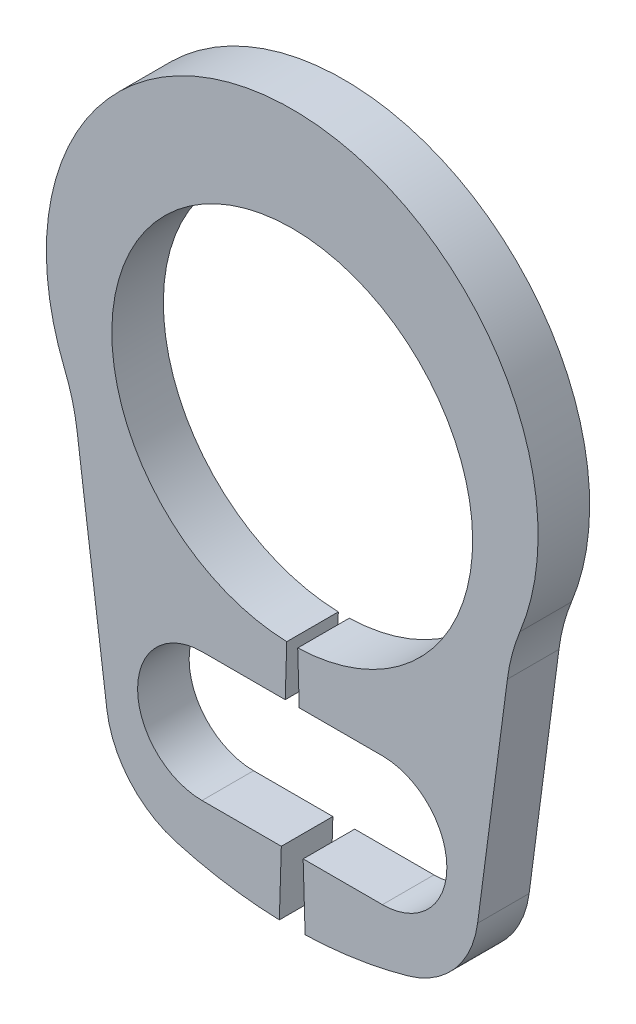
ISO-10303-21;
HEADER;
FILE_DESCRIPTION(('STEP AP214'),'2;1');
FILE_NAME('part.step','',(''),(''),'','','');
FILE_SCHEMA(('AUTOMOTIVE_DESIGN { 1 0 10303 214 1 1 1 1 }'));
ENDSEC;
DATA;
#1=APPLICATION_CONTEXT('core data for automotive mechanical design processes');
#2=APPLICATION_PROTOCOL_DEFINITION('international standard','automotive_design',2000,#1);
#3=PRODUCT_CONTEXT('',#1,'mechanical');
#4=PRODUCT('Part','Part','',(#3));
#5=PRODUCT_RELATED_PRODUCT_CATEGORY('part','',(#4));
#6=PRODUCT_DEFINITION_FORMATION('','',#4);
#7=PRODUCT_DEFINITION_CONTEXT('part definition',#1,'design');
#8=PRODUCT_DEFINITION('design','',#6,#7);
#9=PRODUCT_DEFINITION_SHAPE('','',#8);
#10=(LENGTH_UNIT() NAMED_UNIT(*) SI_UNIT(.MILLI.,.METRE.));
#11=(NAMED_UNIT(*) PLANE_ANGLE_UNIT() SI_UNIT($,.RADIAN.));
#12=(NAMED_UNIT(*) SI_UNIT($,.STERADIAN.) SOLID_ANGLE_UNIT());
#13=UNCERTAINTY_MEASURE_WITH_UNIT(LENGTH_MEASURE(1.E-05),#10,'distance_accuracy_value','');
#14=(GEOMETRIC_REPRESENTATION_CONTEXT(3) GLOBAL_UNCERTAINTY_ASSIGNED_CONTEXT((#13)) GLOBAL_UNIT_ASSIGNED_CONTEXT((#10,
#11,#12)) REPRESENTATION_CONTEXT('',''));
#15=CARTESIAN_POINT('',(0.,0.,0.));
#16=DIRECTION('',(0.,0.,1.));
#17=DIRECTION('',(1.,0.,0.));
#18=AXIS2_PLACEMENT_3D('',#15,#16,#17);
#19=CARTESIAN_POINT('',(-0.0424242424242425,-1.39935706081569,-0.4));
#20=DIRECTION('',(0.999540757725494,-0.0303030303030303,0.));
#21=DIRECTION('',(0.0303030303030303,0.999540757725494,0.));
#22=AXIS2_PLACEMENT_3D('',#19,#20,#21);
#23=PLANE('',#22);
#24=DIRECTION('',(0.,0.,1.));
#25=VECTOR('',#24,1.);
#26=CARTESIAN_POINT('',(-0.0544385779706045,-1.7956480566498,-0.4));
#27=LINE('',#26,#25);
#28=CARTESIAN_POINT('',(-0.0544385779706045,-1.7956480566498,-0.4));
#29=VERTEX_POINT('',#28);
#30=CARTESIAN_POINT('',(-0.0544385779706045,-1.7956480566498,0.));
#31=VERTEX_POINT('',#30);
#32=EDGE_CURVE('E199',#29,#31,#27,.T.);
#33=ORIENTED_EDGE('',*,*,#32,.F.);
#34=DIRECTION('',(0.0303030303030303,0.999540757725493,0.));
#35=VECTOR('',#34,1.);
#36=CARTESIAN_POINT('',(-0.0424242424242425,-1.39935706081569,-0.4));
#37=LINE('',#36,#35);
#38=CARTESIAN_POINT('',(-0.0424242424242425,-1.39935706081569,-0.4));
#39=VERTEX_POINT('',#38);
#40=EDGE_CURVE('E281',#29,#39,#37,.T.);
#41=ORIENTED_EDGE('',*,*,#40,.T.);
#42=DIRECTION('',(0.,0.,1.));
#43=VECTOR('',#42,1.);
#44=CARTESIAN_POINT('',(-0.0424242424242425,-1.39935706081569,-0.4));
#45=LINE('',#44,#43);
#46=CARTESIAN_POINT('',(-0.0424242424242425,-1.39935706081569,0.));
#47=VERTEX_POINT('',#46);
#48=EDGE_CURVE('E11',#39,#47,#45,.T.);
#49=ORIENTED_EDGE('',*,*,#48,.T.);
#50=DIRECTION('',(0.0303030303030303,0.999540757725493,0.));
#51=VECTOR('',#50,1.);
#52=CARTESIAN_POINT('',(-0.0424242424242425,-1.39935706081569,0.));
#53=LINE('',#52,#51);
#54=EDGE_CURVE('E245',#31,#47,#53,.T.);
#55=ORIENTED_EDGE('',*,*,#54,.F.);
#56=EDGE_LOOP('',(#33,#41,#49,#55));
#57=FACE_BOUND('',#56,.T.);
#58=ADVANCED_FACE('F32',(#57),#23,.T.);
#59=CARTESIAN_POINT('',(0.0424242424242425,-1.39935706081569,-0.4));
#60=DIRECTION('',(-0.999540757725494,-0.0303030303030303,0.));
#61=DIRECTION('',(0.0303030303030303,-0.999540757725494,0.));
#62=AXIS2_PLACEMENT_3D('',#59,#60,#61);
#63=PLANE('',#62);
#64=DIRECTION('',(0.,0.,-1.));
#65=VECTOR('',#64,1.);
#66=CARTESIAN_POINT('',(0.0544385779706045,-1.7956480566498,-0.4));
#67=LINE('',#66,#65);
#68=CARTESIAN_POINT('',(0.0544385779706045,-1.7956480566498,0.));
#69=VERTEX_POINT('',#68);
#70=CARTESIAN_POINT('',(0.0544385779706045,-1.7956480566498,-0.4));
#71=VERTEX_POINT('',#70);
#72=EDGE_CURVE('E203',#69,#71,#67,.T.);
#73=ORIENTED_EDGE('',*,*,#72,.F.);
#74=DIRECTION('',(0.0303030303030303,-0.999540757725493,0.));
#75=VECTOR('',#74,1.);
#76=CARTESIAN_POINT('',(0.0424242424242425,-1.39935706081569,0.));
#77=LINE('',#76,#75);
#78=CARTESIAN_POINT('',(0.0424242424242425,-1.39935706081569,0.));
#79=VERTEX_POINT('',#78);
#80=EDGE_CURVE('E216',#79,#69,#77,.T.);
#81=ORIENTED_EDGE('',*,*,#80,.F.);
#82=DIRECTION('',(0.,0.,1.));
#83=VECTOR('',#82,1.);
#84=CARTESIAN_POINT('',(0.0424242424242425,-1.39935706081569,-0.4));
#85=LINE('',#84,#83);
#86=CARTESIAN_POINT('',(0.0424242424242425,-1.39935706081569,-0.4));
#87=VERTEX_POINT('',#86);
#88=EDGE_CURVE('E36',#87,#79,#85,.T.);
#89=ORIENTED_EDGE('',*,*,#88,.F.);
#90=DIRECTION('',(0.0303030303030303,-0.999540757725493,0.));
#91=VECTOR('',#90,1.);
#92=CARTESIAN_POINT('',(0.0424242424242425,-1.39935706081569,-0.4));
#93=LINE('',#92,#91);
#94=EDGE_CURVE('E251',#87,#71,#93,.T.);
#95=ORIENTED_EDGE('',*,*,#94,.T.);
#96=EDGE_LOOP('',(#73,#81,#89,#95));
#97=FACE_BOUND('',#96,.T.);
#98=ADVANCED_FACE('F315',(#97),#63,.T.);
#99=CARTESIAN_POINT('',(0.,0.,-0.4));
#100=DIRECTION('',(0.,0.,1.));
#101=DIRECTION('',(1.,0.,0.));
#102=AXIS2_PLACEMENT_3D('',#99,#100,#101);
#103=CYLINDRICAL_SURFACE('',#102,1.4);
#104=CARTESIAN_POINT('',(0.,0.,0.));
#105=DIRECTION('',(0.,0.,-1.));
#106=DIRECTION('',(1.,0.,0.));
#107=AXIS2_PLACEMENT_3D('',#104,#105,#106);
#108=CIRCLE('',#107,1.4);
#109=EDGE_CURVE('E212',#47,#79,#108,.T.);
#110=ORIENTED_EDGE('',*,*,#109,.F.);
#111=ORIENTED_EDGE('',*,*,#48,.F.);
#112=CARTESIAN_POINT('',(0.,0.,-0.4));
#113=DIRECTION('',(0.,0.,-1.));
#114=DIRECTION('',(1.,0.,0.));
#115=AXIS2_PLACEMENT_3D('',#112,#113,#114);
#116=CIRCLE('',#115,1.4);
#117=EDGE_CURVE('E247',#39,#87,#116,.T.);
#118=ORIENTED_EDGE('',*,*,#117,.T.);
#119=ORIENTED_EDGE('',*,*,#88,.T.);
#120=EDGE_LOOP('',(#110,#111,#118,#119));
#121=FACE_BOUND('',#120,.T.);
#122=ADVANCED_FACE('F34',(#121),#103,.F.);
#123=DIRECTION('',(0.,0.,-1.));
#124=VECTOR('',#123,1.);
#125=CARTESIAN_POINT('',(-0.0847555311001462,-2.7956480566498,-0.4));
#126=LINE('',#125,#124);
#127=CARTESIAN_POINT('',(-0.0847555311001461,-2.7956480566498,0.));
#128=VERTEX_POINT('',#127);
#129=CARTESIAN_POINT('',(-0.0847555311001461,-2.7956480566498,-0.4));
#130=VERTEX_POINT('',#129);
#131=EDGE_CURVE('E337',#128,#130,#126,.T.);
#132=ORIENTED_EDGE('',*,*,#131,.F.);
#133=CARTESIAN_POINT('',(-0.1,-3.29848450049413,0.));
#134=VERTEX_POINT('',#133);
#135=EDGE_CURVE('E193',#134,#128,#53,.T.);
#136=ORIENTED_EDGE('',*,*,#135,.F.);
#137=DIRECTION('',(0.,0.,1.));
#138=VECTOR('',#137,1.);
#139=CARTESIAN_POINT('',(-0.1,-3.29848450049413,-0.4));
#140=LINE('',#139,#138);
#141=CARTESIAN_POINT('',(-0.1,-3.29848450049413,-0.4));
#142=VERTEX_POINT('',#141);
#143=EDGE_CURVE('E41',#142,#134,#140,.T.);
#144=ORIENTED_EDGE('',*,*,#143,.F.);
#145=EDGE_CURVE('E282',#142,#130,#37,.T.);
#146=ORIENTED_EDGE('',*,*,#145,.T.);
#147=EDGE_LOOP('',(#132,#136,#144,#146));
#148=FACE_BOUND('',#147,.T.);
#149=ADVANCED_FACE('F346',(#148),#23,.T.);
#150=CARTESIAN_POINT('',(0.,0.,-0.4));
#151=DIRECTION('',(0.,0.,1.));
#152=DIRECTION('',(1.,0.,0.));
#153=AXIS2_PLACEMENT_3D('',#150,#151,#152);
#154=CYLINDRICAL_SURFACE('',#153,3.3);
#155=CARTESIAN_POINT('',(0.,0.,0.));
#156=DIRECTION('',(0.,0.,1.));
#157=DIRECTION('',(1.,0.,0.));
#158=AXIS2_PLACEMENT_3D('',#155,#156,#157);
#159=CIRCLE('',#158,3.3);
#160=CARTESIAN_POINT('',(-0.89940099633488,-3.17507131381199,0.));
#161=VERTEX_POINT('',#160);
#162=EDGE_CURVE('E243',#161,#134,#159,.T.);
#163=ORIENTED_EDGE('',*,*,#162,.F.);
#164=DIRECTION('',(0.,0.,1.));
#165=VECTOR('',#164,1.);
#166=CARTESIAN_POINT('',(-0.89940099633488,-3.17507131381199,-0.4));
#167=LINE('',#166,#165);
#168=CARTESIAN_POINT('',(-0.89940099633488,-3.17507131381199,-0.4));
#169=VERTEX_POINT('',#168);
#170=EDGE_CURVE('E286',#169,#161,#167,.T.);
#171=ORIENTED_EDGE('',*,*,#170,.F.);
#172=CARTESIAN_POINT('',(0.,0.,-0.4));
#173=DIRECTION('',(0.,0.,1.));
#174=DIRECTION('',(1.,0.,0.));
#175=AXIS2_PLACEMENT_3D('',#172,#173,#174);
#176=CIRCLE('',#175,3.3);
#177=EDGE_CURVE('E278',#169,#142,#176,.T.);
#178=ORIENTED_EDGE('',*,*,#177,.T.);
#179=ORIENTED_EDGE('',*,*,#143,.T.);
#180=EDGE_LOOP('',(#163,#171,#178,#179));
#181=FACE_BOUND('',#180,.T.);
#182=ADVANCED_FACE('F349',(#181),#154,.T.);
#183=CARTESIAN_POINT('',(-0.694991678986044,-2.45346419703654,-0.4));
#184=DIRECTION('',(0.,0.,1.));
#185=DIRECTION('',(1.,0.,0.));
#186=AXIS2_PLACEMENT_3D('',#183,#184,#185);
#187=CYLINDRICAL_SURFACE('',#186,0.749999999999999);
#188=CARTESIAN_POINT('',(-0.694991678986044,-2.45346419703654,0.));
#189=DIRECTION('',(0.,0.,1.));
#190=DIRECTION('',(1.,0.,0.));
#191=AXIS2_PLACEMENT_3D('',#188,#189,#190);
#192=CIRCLE('',#191,0.749999999999999);
#193=CARTESIAN_POINT('',(-1.4385753250164,-2.55135884120158,0.));
#194=VERTEX_POINT('',#193);
#195=EDGE_CURVE('E240',#194,#161,#192,.T.);
#196=ORIENTED_EDGE('',*,*,#195,.F.);
#197=DIRECTION('',(0.,0.,1.));
#198=VECTOR('',#197,1.);
#199=CARTESIAN_POINT('',(-1.4385753250164,-2.55135884120158,-0.4));
#200=LINE('',#199,#198);
#201=CARTESIAN_POINT('',(-1.4385753250164,-2.55135884120158,-0.4));
#202=VERTEX_POINT('',#201);
#203=EDGE_CURVE('E288',#202,#194,#200,.T.);
#204=ORIENTED_EDGE('',*,*,#203,.F.);
#205=CARTESIAN_POINT('',(-0.694991678986044,-2.45346419703654,-0.4));
#206=DIRECTION('',(0.,0.,1.));
#207=DIRECTION('',(1.,0.,0.));
#208=AXIS2_PLACEMENT_3D('',#205,#206,#207);
#209=CIRCLE('',#208,0.749999999999999);
#210=EDGE_CURVE('E275',#202,#169,#209,.T.);
#211=ORIENTED_EDGE('',*,*,#210,.T.);
#212=ORIENTED_EDGE('',*,*,#170,.T.);
#213=EDGE_LOOP('',(#196,#204,#211,#212));
#214=FACE_BOUND('',#213,.T.);
#215=ADVANCED_FACE('F354',(#214),#187,.T.);
#216=CARTESIAN_POINT('',(-1.66974725130108,-0.795433731378155,-0.4));
#217=DIRECTION('',(-0.99144486137381,-0.130526192220053,0.));
#218=DIRECTION('',(0.130526192220053,-0.99144486137381,0.));
#219=AXIS2_PLACEMENT_3D('',#216,#217,#218);
#220=PLANE('',#219);
#221=DIRECTION('',(0.130526192220053,-0.99144486137381,0.));
#222=VECTOR('',#221,1.);
#223=CARTESIAN_POINT('',(-1.66974725130108,-0.795433731378155,0.));
#224=LINE('',#223,#222);
#225=CARTESIAN_POINT('',(-1.66974725130108,-0.795433731378155,0.));
#226=VERTEX_POINT('',#225);
#227=EDGE_CURVE('E237',#226,#194,#224,.T.);
#228=ORIENTED_EDGE('',*,*,#227,.F.);
#229=DIRECTION('',(0.,0.,1.));
#230=VECTOR('',#229,1.);
#231=CARTESIAN_POINT('',(-1.66974725130108,-0.795433731378155,-0.4));
#232=LINE('',#231,#230);
#233=CARTESIAN_POINT('',(-1.66974725130108,-0.795433731378155,-0.4));
#234=VERTEX_POINT('',#233);
#235=EDGE_CURVE('E290',#234,#226,#232,.T.);
#236=ORIENTED_EDGE('',*,*,#235,.F.);
#237=DIRECTION('',(0.130526192220053,-0.99144486137381,0.));
#238=VECTOR('',#237,1.);
#239=CARTESIAN_POINT('',(-1.66974725130108,-0.795433731378155,-0.4));
#240=LINE('',#239,#238);
#241=EDGE_CURVE('E272',#234,#202,#240,.T.);
#242=ORIENTED_EDGE('',*,*,#241,.T.);
#243=ORIENTED_EDGE('',*,*,#203,.T.);
#244=EDGE_LOOP('',(#228,#236,#242,#243));
#245=FACE_BOUND('',#244,.T.);
#246=ADVANCED_FACE('F357',(#245),#220,.T.);
#247=CARTESIAN_POINT('',(-3.14798447228293,-0.990047353547068,-0.4));
#248=DIRECTION('',(0.,0.,1.));
#249=DIRECTION('',(1.,0.,0.));
#250=AXIS2_PLACEMENT_3D('',#247,#248,#249);
#251=CYLINDRICAL_SURFACE('',#250,1.49099287168982);
#252=CARTESIAN_POINT('',(-3.14798447228293,-0.990047353547068,0.));
#253=DIRECTION('',(0.,0.,-1.));
#254=DIRECTION('',(1.,0.,0.));
#255=AXIS2_PLACEMENT_3D('',#252,#253,#254);
#256=CIRCLE('',#255,1.49099287168982);
#257=CARTESIAN_POINT('',(-1.76711123497432,-0.427687285694901,0.));
#258=VERTEX_POINT('',#257);
#259=EDGE_CURVE('E234',#258,#226,#256,.T.);
#260=ORIENTED_EDGE('',*,*,#259,.F.);
#261=DIRECTION('',(0.,0.,1.));
#262=VECTOR('',#261,1.);
#263=CARTESIAN_POINT('',(-1.76711123497432,-0.427687285694901,-0.4));
#264=LINE('',#263,#262);
#265=CARTESIAN_POINT('',(-1.76711123497432,-0.427687285694901,-0.4));
#266=VERTEX_POINT('',#265);
#267=EDGE_CURVE('E292',#266,#258,#264,.T.);
#268=ORIENTED_EDGE('',*,*,#267,.F.);
#269=CARTESIAN_POINT('',(-3.14798447228293,-0.990047353547068,-0.4));
#270=DIRECTION('',(0.,0.,-1.));
#271=DIRECTION('',(1.,0.,0.));
#272=AXIS2_PLACEMENT_3D('',#269,#270,#271);
#273=CIRCLE('',#272,1.49099287168982);
#274=EDGE_CURVE('E269',#266,#234,#273,.T.);
#275=ORIENTED_EDGE('',*,*,#274,.T.);
#276=ORIENTED_EDGE('',*,*,#235,.T.);
#277=EDGE_LOOP('',(#260,#268,#275,#276));
#278=FACE_BOUND('',#277,.T.);
#279=ADVANCED_FACE('F362',(#278),#251,.F.);
#280=CARTESIAN_POINT('',(0.,0.291968050619212,-0.4));
#281=DIRECTION('',(0.,0.,1.));
#282=DIRECTION('',(1.,0.,0.));
#283=AXIS2_PLACEMENT_3D('',#280,#281,#282);
#284=CYLINDRICAL_SURFACE('',#283,1.90803194938079);
#285=CARTESIAN_POINT('',(0.,0.291968050619212,0.));
#286=DIRECTION('',(0.,0.,1.));
#287=DIRECTION('',(1.,0.,0.));
#288=AXIS2_PLACEMENT_3D('',#285,#286,#287);
#289=CIRCLE('',#288,1.90803194938079);
#290=CARTESIAN_POINT('',(1.76711123497432,-0.427687285694902,0.));
#291=VERTEX_POINT('',#290);
#292=EDGE_CURVE('E231',#291,#258,#289,.T.);
#293=ORIENTED_EDGE('',*,*,#292,.F.);
#294=DIRECTION('',(0.,0.,1.));
#295=VECTOR('',#294,1.);
#296=CARTESIAN_POINT('',(1.76711123497432,-0.427687285694902,-0.4));
#297=LINE('',#296,#295);
#298=CARTESIAN_POINT('',(1.76711123497432,-0.427687285694902,-0.4));
#299=VERTEX_POINT('',#298);
#300=EDGE_CURVE('E294',#299,#291,#297,.T.);
#301=ORIENTED_EDGE('',*,*,#300,.F.);
#302=CARTESIAN_POINT('',(0.,0.291968050619212,-0.4));
#303=DIRECTION('',(0.,0.,1.));
#304=DIRECTION('',(1.,0.,0.));
#305=AXIS2_PLACEMENT_3D('',#302,#303,#304);
#306=CIRCLE('',#305,1.90803194938079);
#307=EDGE_CURVE('E266',#299,#266,#306,.T.);
#308=ORIENTED_EDGE('',*,*,#307,.T.);
#309=ORIENTED_EDGE('',*,*,#267,.T.);
#310=EDGE_LOOP('',(#293,#301,#308,#309));
#311=FACE_BOUND('',#310,.T.);
#312=ADVANCED_FACE('F365',(#311),#284,.T.);
#313=CARTESIAN_POINT('',(3.14798447228293,-0.990047353547068,-0.4));
#314=DIRECTION('',(0.,0.,1.));
#315=DIRECTION('',(1.,0.,0.));
#316=AXIS2_PLACEMENT_3D('',#313,#314,#315);
#317=CYLINDRICAL_SURFACE('',#316,1.49099287168982);
#318=CARTESIAN_POINT('',(3.14798447228293,-0.990047353547068,0.));
#319=DIRECTION('',(0.,0.,-1.));
#320=DIRECTION('',(1.,0.,0.));
#321=AXIS2_PLACEMENT_3D('',#318,#319,#320);
#322=CIRCLE('',#321,1.49099287168982);
#323=CARTESIAN_POINT('',(1.66974725130108,-0.795433731378155,0.));
#324=VERTEX_POINT('',#323);
#325=EDGE_CURVE('E228',#324,#291,#322,.T.);
#326=ORIENTED_EDGE('',*,*,#325,.F.);
#327=DIRECTION('',(0.,0.,1.));
#328=VECTOR('',#327,1.);
#329=CARTESIAN_POINT('',(1.66974725130108,-0.795433731378155,-0.4));
#330=LINE('',#329,#328);
#331=CARTESIAN_POINT('',(1.66974725130108,-0.795433731378155,-0.4));
#332=VERTEX_POINT('',#331);
#333=EDGE_CURVE('E296',#332,#324,#330,.T.);
#334=ORIENTED_EDGE('',*,*,#333,.F.);
#335=CARTESIAN_POINT('',(3.14798447228293,-0.990047353547068,-0.4));
#336=DIRECTION('',(0.,0.,-1.));
#337=DIRECTION('',(1.,0.,0.));
#338=AXIS2_PLACEMENT_3D('',#335,#336,#337);
#339=CIRCLE('',#338,1.49099287168982);
#340=EDGE_CURVE('E263',#332,#299,#339,.T.);
#341=ORIENTED_EDGE('',*,*,#340,.T.);
#342=ORIENTED_EDGE('',*,*,#300,.T.);
#343=EDGE_LOOP('',(#326,#334,#341,#342));
#344=FACE_BOUND('',#343,.T.);
#345=ADVANCED_FACE('F370',(#344),#317,.F.);
#346=CARTESIAN_POINT('',(1.66974725130108,-0.795433731378155,-0.4));
#347=DIRECTION('',(0.99144486137381,-0.130526192220053,0.));
#348=DIRECTION('',(0.130526192220053,0.99144486137381,0.));
#349=AXIS2_PLACEMENT_3D('',#346,#347,#348);
#350=PLANE('',#349);
#351=DIRECTION('',(0.130526192220053,0.99144486137381,0.));
#352=VECTOR('',#351,1.);
#353=CARTESIAN_POINT('',(1.66974725130108,-0.795433731378155,0.));
#354=LINE('',#353,#352);
#355=CARTESIAN_POINT('',(1.4385753250164,-2.55135884120158,0.));
#356=VERTEX_POINT('',#355);
#357=EDGE_CURVE('E225',#356,#324,#354,.T.);
#358=ORIENTED_EDGE('',*,*,#357,.F.);
#359=DIRECTION('',(0.,0.,1.));
#360=VECTOR('',#359,1.);
#361=CARTESIAN_POINT('',(1.4385753250164,-2.55135884120158,-0.4));
#362=LINE('',#361,#360);
#363=CARTESIAN_POINT('',(1.4385753250164,-2.55135884120158,-0.4));
#364=VERTEX_POINT('',#363);
#365=EDGE_CURVE('E298',#364,#356,#362,.T.);
#366=ORIENTED_EDGE('',*,*,#365,.F.);
#367=DIRECTION('',(0.130526192220053,0.99144486137381,0.));
#368=VECTOR('',#367,1.);
#369=CARTESIAN_POINT('',(1.66974725130108,-0.795433731378155,-0.4));
#370=LINE('',#369,#368);
#371=EDGE_CURVE('E260',#364,#332,#370,.T.);
#372=ORIENTED_EDGE('',*,*,#371,.T.);
#373=ORIENTED_EDGE('',*,*,#333,.T.);
#374=EDGE_LOOP('',(#358,#366,#372,#373));
#375=FACE_BOUND('',#374,.T.);
#376=ADVANCED_FACE('F373',(#375),#350,.T.);
#377=CARTESIAN_POINT('',(0.694991678986044,-2.45346419703654,-0.4));
#378=DIRECTION('',(0.,0.,1.));
#379=DIRECTION('',(1.,0.,0.));
#380=AXIS2_PLACEMENT_3D('',#377,#378,#379);
#381=CYLINDRICAL_SURFACE('',#380,0.749999999999999);
#382=CARTESIAN_POINT('',(0.694991678986044,-2.45346419703654,0.));
#383=DIRECTION('',(0.,0.,1.));
#384=DIRECTION('',(-1.,0.,0.));
#385=AXIS2_PLACEMENT_3D('',#382,#383,#384);
#386=CIRCLE('',#385,0.749999999999999);
#387=CARTESIAN_POINT('',(0.89940099633488,-3.17507131381199,0.));
#388=VERTEX_POINT('',#387);
#389=EDGE_CURVE('E222',#388,#356,#386,.T.);
#390=ORIENTED_EDGE('',*,*,#389,.F.);
#391=DIRECTION('',(0.,0.,1.));
#392=VECTOR('',#391,1.);
#393=CARTESIAN_POINT('',(0.89940099633488,-3.17507131381199,-0.4));
#394=LINE('',#393,#392);
#395=CARTESIAN_POINT('',(0.89940099633488,-3.17507131381199,-0.4));
#396=VERTEX_POINT('',#395);
#397=EDGE_CURVE('E300',#396,#388,#394,.T.);
#398=ORIENTED_EDGE('',*,*,#397,.F.);
#399=CARTESIAN_POINT('',(0.694991678986044,-2.45346419703654,-0.4));
#400=DIRECTION('',(0.,0.,1.));
#401=DIRECTION('',(-1.,0.,0.));
#402=AXIS2_PLACEMENT_3D('',#399,#400,#401);
#403=CIRCLE('',#402,0.749999999999999);
#404=EDGE_CURVE('E257',#396,#364,#403,.T.);
#405=ORIENTED_EDGE('',*,*,#404,.T.);
#406=ORIENTED_EDGE('',*,*,#365,.T.);
#407=EDGE_LOOP('',(#390,#398,#405,#406));
#408=FACE_BOUND('',#407,.T.);
#409=ADVANCED_FACE('F378',(#408),#381,.T.);
#410=CARTESIAN_POINT('',(0.,0.,-0.4));
#411=DIRECTION('',(0.,0.,1.));
#412=DIRECTION('',(1.,0.,0.));
#413=AXIS2_PLACEMENT_3D('',#410,#411,#412);
#414=CYLINDRICAL_SURFACE('',#413,3.3);
#415=CARTESIAN_POINT('',(0.,0.,0.));
#416=DIRECTION('',(0.,0.,1.));
#417=DIRECTION('',(1.,0.,0.));
#418=AXIS2_PLACEMENT_3D('',#415,#416,#417);
#419=CIRCLE('',#418,3.3);
#420=CARTESIAN_POINT('',(0.1,-3.29848450049413,0.));
#421=VERTEX_POINT('',#420);
#422=EDGE_CURVE('E219',#421,#388,#419,.T.);
#423=ORIENTED_EDGE('',*,*,#422,.F.);
#424=DIRECTION('',(0.,0.,1.));
#425=VECTOR('',#424,1.);
#426=CARTESIAN_POINT('',(0.1,-3.29848450049413,-0.4));
#427=LINE('',#426,#425);
#428=CARTESIAN_POINT('',(0.1,-3.29848450049413,-0.4));
#429=VERTEX_POINT('',#428);
#430=EDGE_CURVE('E301',#429,#421,#427,.T.);
#431=ORIENTED_EDGE('',*,*,#430,.F.);
#432=CARTESIAN_POINT('',(0.,0.,-0.4));
#433=DIRECTION('',(0.,0.,1.));
#434=DIRECTION('',(1.,0.,0.));
#435=AXIS2_PLACEMENT_3D('',#432,#433,#434);
#436=CIRCLE('',#435,3.3);
#437=EDGE_CURVE('E254',#429,#396,#436,.T.);
#438=ORIENTED_EDGE('',*,*,#437,.T.);
#439=ORIENTED_EDGE('',*,*,#397,.T.);
#440=EDGE_LOOP('',(#423,#431,#438,#439));
#441=FACE_BOUND('',#440,.T.);
#442=ADVANCED_FACE('F380',(#441),#414,.T.);
#443=DIRECTION('',(0.,0.,1.));
#444=VECTOR('',#443,1.);
#445=CARTESIAN_POINT('',(0.0847555311001462,-2.7956480566498,-0.4));
#446=LINE('',#445,#444);
#447=CARTESIAN_POINT('',(0.0847555311001461,-2.7956480566498,-0.4));
#448=VERTEX_POINT('',#447);
#449=CARTESIAN_POINT('',(0.0847555311001461,-2.7956480566498,0.));
#450=VERTEX_POINT('',#449);
#451=EDGE_CURVE('E333',#448,#450,#446,.T.);
#452=ORIENTED_EDGE('',*,*,#451,.F.);
#453=EDGE_CURVE('E250',#448,#429,#93,.T.);
#454=ORIENTED_EDGE('',*,*,#453,.T.);
#455=ORIENTED_EDGE('',*,*,#430,.T.);
#456=EDGE_CURVE('E215',#450,#421,#77,.T.);
#457=ORIENTED_EDGE('',*,*,#456,.F.);
#458=EDGE_LOOP('',(#452,#454,#455,#457));
#459=FACE_BOUND('',#458,.T.);
#460=ADVANCED_FACE('F383',(#459),#63,.T.);
#461=CARTESIAN_POINT('',(0.,0.,-0.4));
#462=DIRECTION('',(0.,0.,1.));
#463=DIRECTION('',(1.,0.,0.));
#464=AXIS2_PLACEMENT_3D('',#461,#462,#463);
#465=PLANE('',#464);
#466=CARTESIAN_POINT('',(0.7,-2.2956480566498,-0.4));
#467=DIRECTION('',(0.,0.,1.));
#468=DIRECTION('',(1.,0.,0.));
#469=AXIS2_PLACEMENT_3D('',#466,#467,#468);
#470=CIRCLE('',#469,0.5);
#471=CARTESIAN_POINT('',(0.7,-2.7956480566498,-0.4));
#472=VERTEX_POINT('',#471);
#473=CARTESIAN_POINT('',(0.7,-1.7956480566498,-0.4));
#474=VERTEX_POINT('',#473);
#475=EDGE_CURVE('E209',#472,#474,#470,.T.);
#476=ORIENTED_EDGE('',*,*,#475,.T.);
#477=DIRECTION('',(-1.,0.,0.));
#478=VECTOR('',#477,1.);
#479=CARTESIAN_POINT('',(-0.7,-1.7956480566498,-0.4));
#480=LINE('',#479,#478);
#481=EDGE_CURVE('E57',#474,#71,#480,.T.);
#482=ORIENTED_EDGE('',*,*,#481,.T.);
#483=ORIENTED_EDGE('',*,*,#94,.F.);
#484=ORIENTED_EDGE('',*,*,#117,.F.);
#485=ORIENTED_EDGE('',*,*,#40,.F.);
#486=CARTESIAN_POINT('',(-0.7,-1.7956480566498,-0.4));
#487=VERTEX_POINT('',#486);
#488=EDGE_CURVE('E194',#29,#487,#480,.T.);
#489=ORIENTED_EDGE('',*,*,#488,.T.);
#490=CARTESIAN_POINT('',(-0.7,-2.2956480566498,-0.4));
#491=DIRECTION('',(0.,0.,1.));
#492=DIRECTION('',(1.,0.,0.));
#493=AXIS2_PLACEMENT_3D('',#490,#491,#492);
#494=CIRCLE('',#493,0.5);
#495=CARTESIAN_POINT('',(-0.7,-2.7956480566498,-0.4));
#496=VERTEX_POINT('',#495);
#497=EDGE_CURVE('E198',#487,#496,#494,.T.);
#498=ORIENTED_EDGE('',*,*,#497,.T.);
#499=DIRECTION('',(1.,0.,0.));
#500=VECTOR('',#499,1.);
#501=CARTESIAN_POINT('',(0.7,-2.7956480566498,-0.4));
#502=LINE('',#501,#500);
#503=EDGE_CURVE('E176',#496,#130,#502,.T.);
#504=ORIENTED_EDGE('',*,*,#503,.T.);
#505=ORIENTED_EDGE('',*,*,#145,.F.);
#506=ORIENTED_EDGE('',*,*,#177,.F.);
#507=ORIENTED_EDGE('',*,*,#210,.F.);
#508=ORIENTED_EDGE('',*,*,#241,.F.);
#509=ORIENTED_EDGE('',*,*,#274,.F.);
#510=ORIENTED_EDGE('',*,*,#307,.F.);
#511=ORIENTED_EDGE('',*,*,#340,.F.);
#512=ORIENTED_EDGE('',*,*,#371,.F.);
#513=ORIENTED_EDGE('',*,*,#404,.F.);
#514=ORIENTED_EDGE('',*,*,#437,.F.);
#515=ORIENTED_EDGE('',*,*,#453,.F.);
#516=EDGE_CURVE('E326',#448,#472,#502,.T.);
#517=ORIENTED_EDGE('',*,*,#516,.T.);
#518=EDGE_LOOP('',(#476,#482,#483,#484,#485,#489,#498,#504,#505,#506,#507,#508,#509,#510,#511,
#512,#513,#514,#515,#517));
#519=FACE_BOUND('',#518,.T.);
#520=ADVANCED_FACE('F322',(#519),#465,.F.);
#521=CARTESIAN_POINT('',(0.,0.,0.));
#522=DIRECTION('',(0.,0.,1.));
#523=DIRECTION('',(1.,0.,0.));
#524=AXIS2_PLACEMENT_3D('',#521,#522,#523);
#525=PLANE('',#524);
#526=DIRECTION('',(-1.,0.,0.));
#527=VECTOR('',#526,1.);
#528=CARTESIAN_POINT('',(-0.7,-1.7956480566498,0.));
#529=LINE('',#528,#527);
#530=CARTESIAN_POINT('',(0.7,-1.7956480566498,0.));
#531=VERTEX_POINT('',#530);
#532=EDGE_CURVE('E339',#531,#69,#529,.T.);
#533=ORIENTED_EDGE('',*,*,#532,.F.);
#534=CARTESIAN_POINT('',(0.7,-2.2956480566498,0.));
#535=DIRECTION('',(0.,0.,1.));
#536=DIRECTION('',(1.,0.,0.));
#537=AXIS2_PLACEMENT_3D('',#534,#535,#536);
#538=CIRCLE('',#537,0.5);
#539=CARTESIAN_POINT('',(0.7,-2.7956480566498,0.));
#540=VERTEX_POINT('',#539);
#541=EDGE_CURVE('E201',#540,#531,#538,.T.);
#542=ORIENTED_EDGE('',*,*,#541,.F.);
#543=DIRECTION('',(1.,0.,0.));
#544=VECTOR('',#543,1.);
#545=CARTESIAN_POINT('',(0.7,-2.7956480566498,0.));
#546=LINE('',#545,#544);
#547=EDGE_CURVE('E49',#450,#540,#546,.T.);
#548=ORIENTED_EDGE('',*,*,#547,.F.);
#549=ORIENTED_EDGE('',*,*,#456,.T.);
#550=ORIENTED_EDGE('',*,*,#422,.T.);
#551=ORIENTED_EDGE('',*,*,#389,.T.);
#552=ORIENTED_EDGE('',*,*,#357,.T.);
#553=ORIENTED_EDGE('',*,*,#325,.T.);
#554=ORIENTED_EDGE('',*,*,#292,.T.);
#555=ORIENTED_EDGE('',*,*,#259,.T.);
#556=ORIENTED_EDGE('',*,*,#227,.T.);
#557=ORIENTED_EDGE('',*,*,#195,.T.);
#558=ORIENTED_EDGE('',*,*,#162,.T.);
#559=ORIENTED_EDGE('',*,*,#135,.T.);
#560=CARTESIAN_POINT('',(-0.7,-2.7956480566498,0.));
#561=VERTEX_POINT('',#560);
#562=EDGE_CURVE('E173',#561,#128,#546,.T.);
#563=ORIENTED_EDGE('',*,*,#562,.F.);
#564=CARTESIAN_POINT('',(-0.7,-2.2956480566498,0.));
#565=DIRECTION('',(0.,0.,1.));
#566=DIRECTION('',(1.,0.,0.));
#567=AXIS2_PLACEMENT_3D('',#564,#565,#566);
#568=CIRCLE('',#567,0.5);
#569=CARTESIAN_POINT('',(-0.7,-1.7956480566498,0.));
#570=VERTEX_POINT('',#569);
#571=EDGE_CURVE('E190',#570,#561,#568,.T.);
#572=ORIENTED_EDGE('',*,*,#571,.F.);
#573=EDGE_CURVE('E317',#31,#570,#529,.T.);
#574=ORIENTED_EDGE('',*,*,#573,.F.);
#575=ORIENTED_EDGE('',*,*,#54,.T.);
#576=ORIENTED_EDGE('',*,*,#109,.T.);
#577=ORIENTED_EDGE('',*,*,#80,.T.);
#578=EDGE_LOOP('',(#533,#542,#548,#549,#550,#551,#552,#553,#554,#555,#556,#557,#558,#559,#563,
#572,#574,#575,#576,#577));
#579=FACE_BOUND('',#578,.T.);
#580=ADVANCED_FACE('F188',(#579),#525,.T.);
#581=CARTESIAN_POINT('',(0.7,-2.2956480566498,-0.4));
#582=DIRECTION('',(0.,0.,1.));
#583=DIRECTION('',(1.,0.,0.));
#584=AXIS2_PLACEMENT_3D('',#581,#582,#583);
#585=CYLINDRICAL_SURFACE('',#584,0.5);
#586=ORIENTED_EDGE('',*,*,#541,.T.);
#587=DIRECTION('',(0.,0.,1.));
#588=VECTOR('',#587,1.);
#589=CARTESIAN_POINT('',(0.7,-1.7956480566498,-0.4));
#590=LINE('',#589,#588);
#591=EDGE_CURVE('E331',#474,#531,#590,.T.);
#592=ORIENTED_EDGE('',*,*,#591,.F.);
#593=ORIENTED_EDGE('',*,*,#475,.F.);
#594=DIRECTION('',(0.,0.,1.));
#595=VECTOR('',#594,1.);
#596=CARTESIAN_POINT('',(0.7,-2.7956480566498,-0.4));
#597=LINE('',#596,#595);
#598=EDGE_CURVE('E181',#472,#540,#597,.T.);
#599=ORIENTED_EDGE('',*,*,#598,.T.);
#600=EDGE_LOOP('',(#586,#592,#593,#599));
#601=FACE_BOUND('',#600,.T.);
#602=ADVANCED_FACE('F386',(#601),#585,.F.);
#603=CARTESIAN_POINT('',(-0.7,-2.2956480566498,-0.4));
#604=DIRECTION('',(0.,0.,1.));
#605=DIRECTION('',(1.,0.,0.));
#606=AXIS2_PLACEMENT_3D('',#603,#604,#605);
#607=CYLINDRICAL_SURFACE('',#606,0.5);
#608=ORIENTED_EDGE('',*,*,#571,.T.);
#609=DIRECTION('',(0.,0.,1.));
#610=VECTOR('',#609,1.);
#611=CARTESIAN_POINT('',(-0.7,-2.7956480566498,-0.4));
#612=LINE('',#611,#610);
#613=EDGE_CURVE('E170',#496,#561,#612,.T.);
#614=ORIENTED_EDGE('',*,*,#613,.F.);
#615=ORIENTED_EDGE('',*,*,#497,.F.);
#616=DIRECTION('',(0.,0.,1.));
#617=VECTOR('',#616,1.);
#618=CARTESIAN_POINT('',(-0.7,-1.7956480566498,-0.4));
#619=LINE('',#618,#617);
#620=EDGE_CURVE('E182',#487,#570,#619,.T.);
#621=ORIENTED_EDGE('',*,*,#620,.T.);
#622=EDGE_LOOP('',(#608,#614,#615,#621));
#623=FACE_BOUND('',#622,.T.);
#624=ADVANCED_FACE('F197',(#623),#607,.F.);
#625=CARTESIAN_POINT('',(-0.7,-1.7956480566498,-0.4));
#626=DIRECTION('',(0.,1.,0.));
#627=DIRECTION('',(0.,0.,1.));
#628=AXIS2_PLACEMENT_3D('',#625,#626,#627);
#629=PLANE('',#628);
#630=ORIENTED_EDGE('',*,*,#32,.T.);
#631=ORIENTED_EDGE('',*,*,#573,.T.);
#632=ORIENTED_EDGE('',*,*,#620,.F.);
#633=ORIENTED_EDGE('',*,*,#488,.F.);
#634=EDGE_LOOP('',(#630,#631,#632,#633));
#635=FACE_BOUND('',#634,.T.);
#636=ADVANCED_FACE('F342',(#635),#629,.F.);
#637=CARTESIAN_POINT('',(0.7,-2.7956480566498,-0.4));
#638=DIRECTION('',(0.,-1.,0.));
#639=DIRECTION('',(1.,0.,0.));
#640=AXIS2_PLACEMENT_3D('',#637,#638,#639);
#641=PLANE('',#640);
#642=ORIENTED_EDGE('',*,*,#131,.T.);
#643=ORIENTED_EDGE('',*,*,#503,.F.);
#644=ORIENTED_EDGE('',*,*,#613,.T.);
#645=ORIENTED_EDGE('',*,*,#562,.T.);
#646=EDGE_LOOP('',(#642,#643,#644,#645));
#647=FACE_BOUND('',#646,.T.);
#648=ADVANCED_FACE('F172',(#647),#641,.F.);
#649=ORIENTED_EDGE('',*,*,#451,.T.);
#650=ORIENTED_EDGE('',*,*,#547,.T.);
#651=ORIENTED_EDGE('',*,*,#598,.F.);
#652=ORIENTED_EDGE('',*,*,#516,.F.);
#653=EDGE_LOOP('',(#649,#650,#651,#652));
#654=FACE_BOUND('',#653,.T.);
#655=ADVANCED_FACE('F384',(#654),#641,.F.);
#656=ORIENTED_EDGE('',*,*,#72,.T.);
#657=ORIENTED_EDGE('',*,*,#481,.F.);
#658=ORIENTED_EDGE('',*,*,#591,.T.);
#659=ORIENTED_EDGE('',*,*,#532,.T.);
#660=EDGE_LOOP('',(#656,#657,#658,#659));
#661=FACE_BOUND('',#660,.T.);
#662=ADVANCED_FACE('F338',(#661),#629,.F.);
#663=CLOSED_SHELL('',(#58,#98,#122,#149,#182,#215,#246,#279,#312,#345,#376,#409,#442,#460,#520,
#580,#602,#624,#636,#648,#655,#662));
#664=MANIFOLD_SOLID_BREP('B2',#663);
#665=ADVANCED_BREP_SHAPE_REPRESENTATION('',(#18,#664),#14);
#666=SHAPE_DEFINITION_REPRESENTATION(#9,#665);
ENDSEC;
END-ISO-10303-21;
